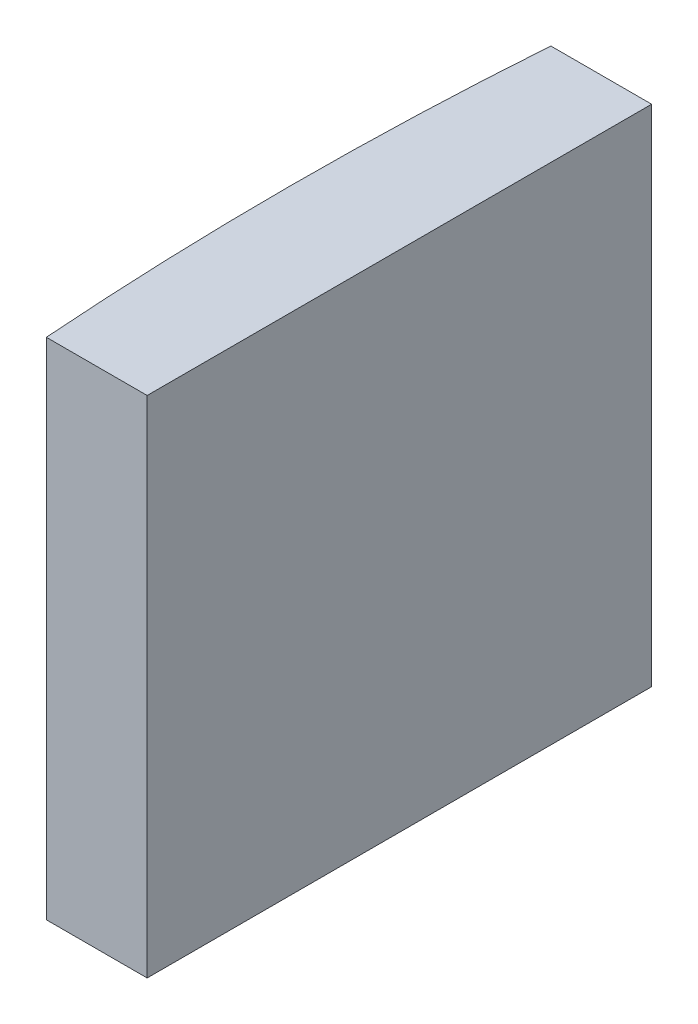
ISO-10303-21;
HEADER;
FILE_DESCRIPTION(('STEP AP214'),'2;1');
FILE_NAME('part.step','',(''),(''),'','','');
FILE_SCHEMA(('AUTOMOTIVE_DESIGN { 1 0 10303 214 1 1 1 1 }'));
ENDSEC;
DATA;
#1=APPLICATION_CONTEXT('core data for automotive mechanical design processes');
#2=APPLICATION_PROTOCOL_DEFINITION('international standard','automotive_design',2000,#1);
#3=PRODUCT_CONTEXT('',#1,'mechanical');
#4=PRODUCT('Part','Part','',(#3));
#5=PRODUCT_RELATED_PRODUCT_CATEGORY('part','',(#4));
#6=PRODUCT_DEFINITION_FORMATION('','',#4);
#7=PRODUCT_DEFINITION_CONTEXT('part definition',#1,'design');
#8=PRODUCT_DEFINITION('design','',#6,#7);
#9=PRODUCT_DEFINITION_SHAPE('','',#8);
#10=(LENGTH_UNIT() NAMED_UNIT(*) SI_UNIT(.MILLI.,.METRE.));
#11=(NAMED_UNIT(*) PLANE_ANGLE_UNIT() SI_UNIT($,.RADIAN.));
#12=(NAMED_UNIT(*) SI_UNIT($,.STERADIAN.) SOLID_ANGLE_UNIT());
#13=UNCERTAINTY_MEASURE_WITH_UNIT(LENGTH_MEASURE(1.E-05),#10,'distance_accuracy_value','');
#14=(GEOMETRIC_REPRESENTATION_CONTEXT(3) GLOBAL_UNCERTAINTY_ASSIGNED_CONTEXT((#13)) GLOBAL_UNIT_ASSIGNED_CONTEXT((#10,
#11,#12)) REPRESENTATION_CONTEXT('',''));
#15=CARTESIAN_POINT('',(0.,0.,0.));
#16=DIRECTION('',(0.,0.,1.));
#17=DIRECTION('',(1.,0.,0.));
#18=AXIS2_PLACEMENT_3D('',#15,#16,#17);
#19=CARTESIAN_POINT('',(4.35520433485127,10.,0.));
#20=DIRECTION('',(0.,-1.,0.));
#21=DIRECTION('',(0.,0.,-1.));
#22=AXIS2_PLACEMENT_3D('',#19,#20,#21);
#23=CYLINDRICAL_SURFACE('',#22,68.78);
#24=CARTESIAN_POINT('',(4.35520433485127,0.,0.));
#25=DIRECTION('',(0.,1.,0.));
#26=DIRECTION('',(0.,0.,1.));
#27=AXIS2_PLACEMENT_3D('',#24,#25,#26);
#28=CIRCLE('',#27,68.78);
#29=CARTESIAN_POINT('',(-64.2428160447486,0.,-5.));
#30=VERTEX_POINT('',#29);
#31=CARTESIAN_POINT('',(-64.2428160447486,0.,5.));
#32=VERTEX_POINT('',#31);
#33=EDGE_CURVE('E100',#30,#32,#28,.T.);
#34=ORIENTED_EDGE('',*,*,#33,.T.);
#35=DIRECTION('',(0.,-1.,0.));
#36=VECTOR('',#35,1.);
#37=CARTESIAN_POINT('',(-64.2428160447486,10.,5.));
#38=LINE('',#37,#36);
#39=CARTESIAN_POINT('',(-64.2428160447486,10.,5.));
#40=VERTEX_POINT('',#39);
#41=EDGE_CURVE('E11',#40,#32,#38,.T.);
#42=ORIENTED_EDGE('',*,*,#41,.F.);
#43=CARTESIAN_POINT('',(4.35520433485127,10.,0.));
#44=DIRECTION('',(0.,1.,0.));
#45=DIRECTION('',(0.,0.,1.));
#46=AXIS2_PLACEMENT_3D('',#43,#44,#45);
#47=CIRCLE('',#46,68.78);
#48=CARTESIAN_POINT('',(-64.2428160447486,10.,-5.));
#49=VERTEX_POINT('',#48);
#50=EDGE_CURVE('E88',#49,#40,#47,.T.);
#51=ORIENTED_EDGE('',*,*,#50,.F.);
#52=DIRECTION('',(0.,-1.,0.));
#53=VECTOR('',#52,1.);
#54=CARTESIAN_POINT('',(-64.2428160447486,10.,-5.));
#55=LINE('',#54,#53);
#56=EDGE_CURVE('E96',#49,#30,#55,.T.);
#57=ORIENTED_EDGE('',*,*,#56,.T.);
#58=EDGE_LOOP('',(#34,#42,#51,#57));
#59=FACE_BOUND('',#58,.T.);
#60=ADVANCED_FACE('F37',(#59),#23,.T.);
#61=CARTESIAN_POINT('',(-64.2428160447486,10.,5.));
#62=DIRECTION('',(0.,0.,-1.));
#63=DIRECTION('',(-1.,0.,0.));
#64=AXIS2_PLACEMENT_3D('',#61,#62,#63);
#65=PLANE('',#64);
#66=DIRECTION('',(1.,0.,0.));
#67=VECTOR('',#66,1.);
#68=CARTESIAN_POINT('',(-64.2428160447486,0.,5.));
#69=LINE('',#68,#67);
#70=CARTESIAN_POINT('',(-62.2447956651488,0.,5.));
#71=VERTEX_POINT('',#70);
#72=EDGE_CURVE('E92',#32,#71,#69,.T.);
#73=ORIENTED_EDGE('',*,*,#72,.T.);
#74=DIRECTION('',(0.,-1.,0.));
#75=VECTOR('',#74,1.);
#76=CARTESIAN_POINT('',(-62.2447956651488,10.,5.));
#77=LINE('',#76,#75);
#78=CARTESIAN_POINT('',(-62.2447956651488,10.,5.));
#79=VERTEX_POINT('',#78);
#80=EDGE_CURVE('E45',#79,#71,#77,.T.);
#81=ORIENTED_EDGE('',*,*,#80,.F.);
#82=DIRECTION('',(1.,0.,0.));
#83=VECTOR('',#82,1.);
#84=CARTESIAN_POINT('',(-64.2428160447486,10.,5.));
#85=LINE('',#84,#83);
#86=EDGE_CURVE('E83',#40,#79,#85,.T.);
#87=ORIENTED_EDGE('',*,*,#86,.F.);
#88=ORIENTED_EDGE('',*,*,#41,.T.);
#89=EDGE_LOOP('',(#73,#81,#87,#88));
#90=FACE_BOUND('',#89,.T.);
#91=ADVANCED_FACE('F91',(#90),#65,.F.);
#92=CARTESIAN_POINT('',(-62.2447956651488,10.,-4.99999999999999));
#93=DIRECTION('',(-1.,0.,0.));
#94=DIRECTION('',(0.,0.,1.));
#95=AXIS2_PLACEMENT_3D('',#92,#93,#94);
#96=PLANE('',#95);
#97=DIRECTION('',(0.,0.,-1.));
#98=VECTOR('',#97,1.);
#99=CARTESIAN_POINT('',(-62.2447956651488,0.,-4.99999999999999));
#100=LINE('',#99,#98);
#101=CARTESIAN_POINT('',(-62.2447956651488,0.,-4.99999999999999));
#102=VERTEX_POINT('',#101);
#103=EDGE_CURVE('E70',#71,#102,#100,.T.);
#104=ORIENTED_EDGE('',*,*,#103,.T.);
#105=DIRECTION('',(0.,-1.,0.));
#106=VECTOR('',#105,1.);
#107=CARTESIAN_POINT('',(-62.2447956651488,10.,-4.99999999999999));
#108=LINE('',#107,#106);
#109=CARTESIAN_POINT('',(-62.2447956651488,10.,-4.99999999999999));
#110=VERTEX_POINT('',#109);
#111=EDGE_CURVE('E93',#110,#102,#108,.T.);
#112=ORIENTED_EDGE('',*,*,#111,.F.);
#113=DIRECTION('',(0.,0.,-1.));
#114=VECTOR('',#113,1.);
#115=CARTESIAN_POINT('',(-62.2447956651488,10.,-4.99999999999999));
#116=LINE('',#115,#114);
#117=EDGE_CURVE('E86',#79,#110,#116,.T.);
#118=ORIENTED_EDGE('',*,*,#117,.F.);
#119=ORIENTED_EDGE('',*,*,#80,.T.);
#120=EDGE_LOOP('',(#104,#112,#118,#119));
#121=FACE_BOUND('',#120,.T.);
#122=ADVANCED_FACE('F94',(#121),#96,.F.);
#123=CARTESIAN_POINT('',(-64.2428160447486,10.,-5.));
#124=DIRECTION('',(0.,0.,1.));
#125=DIRECTION('',(1.,0.,0.));
#126=AXIS2_PLACEMENT_3D('',#123,#124,#125);
#127=PLANE('',#126);
#128=DIRECTION('',(-1.,0.,0.));
#129=VECTOR('',#128,1.);
#130=CARTESIAN_POINT('',(-64.2428160447486,0.,-5.));
#131=LINE('',#130,#129);
#132=EDGE_CURVE('E76',#102,#30,#131,.T.);
#133=ORIENTED_EDGE('',*,*,#132,.T.);
#134=ORIENTED_EDGE('',*,*,#56,.F.);
#135=DIRECTION('',(-1.,0.,0.));
#136=VECTOR('',#135,1.);
#137=CARTESIAN_POINT('',(-64.2428160447486,10.,-5.));
#138=LINE('',#137,#136);
#139=EDGE_CURVE('E53',#110,#49,#138,.T.);
#140=ORIENTED_EDGE('',*,*,#139,.F.);
#141=ORIENTED_EDGE('',*,*,#111,.T.);
#142=EDGE_LOOP('',(#133,#134,#140,#141));
#143=FACE_BOUND('',#142,.T.);
#144=ADVANCED_FACE('F107',(#143),#127,.F.);
#145=CARTESIAN_POINT('',(4.35520433485127,10.,0.));
#146=DIRECTION('',(0.,1.,0.));
#147=DIRECTION('',(0.,0.,1.));
#148=AXIS2_PLACEMENT_3D('',#145,#146,#147);
#149=PLANE('',#148);
#150=ORIENTED_EDGE('',*,*,#50,.T.);
#151=ORIENTED_EDGE('',*,*,#86,.T.);
#152=ORIENTED_EDGE('',*,*,#117,.T.);
#153=ORIENTED_EDGE('',*,*,#139,.T.);
#154=EDGE_LOOP('',(#150,#151,#152,#153));
#155=FACE_BOUND('',#154,.T.);
#156=ADVANCED_FACE('F84',(#155),#149,.T.);
#157=CARTESIAN_POINT('',(4.35520433485127,0.,0.));
#158=DIRECTION('',(0.,1.,0.));
#159=DIRECTION('',(0.,0.,1.));
#160=AXIS2_PLACEMENT_3D('',#157,#158,#159);
#161=PLANE('',#160);
#162=ORIENTED_EDGE('',*,*,#33,.F.);
#163=ORIENTED_EDGE('',*,*,#132,.F.);
#164=ORIENTED_EDGE('',*,*,#103,.F.);
#165=ORIENTED_EDGE('',*,*,#72,.F.);
#166=EDGE_LOOP('',(#162,#163,#164,#165));
#167=FACE_BOUND('',#166,.T.);
#168=ADVANCED_FACE('F110',(#167),#161,.F.);
#169=CLOSED_SHELL('',(#60,#91,#122,#144,#156,#168));
#170=MANIFOLD_SOLID_BREP('B2',#169);
#171=ADVANCED_BREP_SHAPE_REPRESENTATION('',(#18,#170),#14);
#172=SHAPE_DEFINITION_REPRESENTATION(#9,#171);
ENDSEC;
END-ISO-10303-21;
